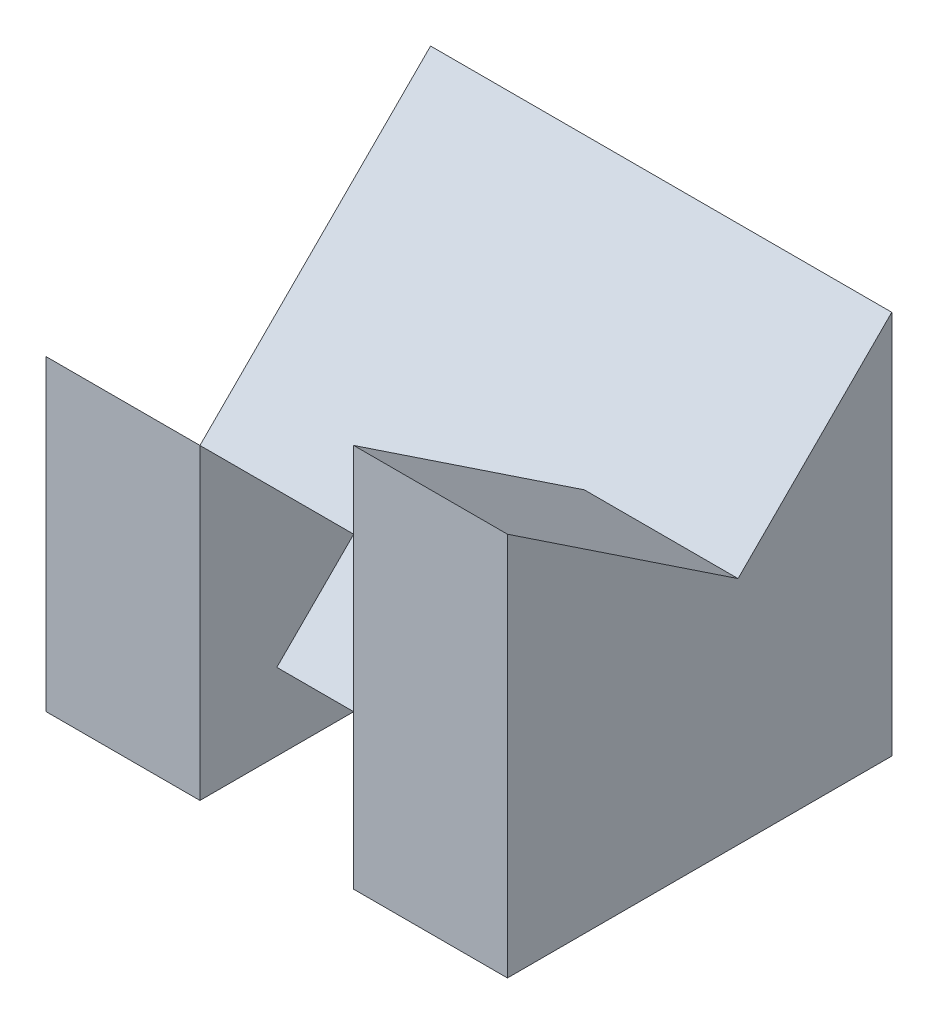
ISO-10303-21;
HEADER;
FILE_DESCRIPTION(('STEP AP214'),'2;1');
FILE_NAME('part.step','',(''),(''),'','','');
FILE_SCHEMA(('AUTOMOTIVE_DESIGN { 1 0 10303 214 1 1 1 1 }'));
ENDSEC;
DATA;
#1=APPLICATION_CONTEXT('core data for automotive mechanical design processes');
#2=APPLICATION_PROTOCOL_DEFINITION('international standard','automotive_design',2000,#1);
#3=PRODUCT_CONTEXT('',#1,'mechanical');
#4=PRODUCT('Part','Part','',(#3));
#5=PRODUCT_RELATED_PRODUCT_CATEGORY('part','',(#4));
#6=PRODUCT_DEFINITION_FORMATION('','',#4);
#7=PRODUCT_DEFINITION_CONTEXT('part definition',#1,'design');
#8=PRODUCT_DEFINITION('design','',#6,#7);
#9=PRODUCT_DEFINITION_SHAPE('','',#8);
#10=(LENGTH_UNIT() NAMED_UNIT(*) SI_UNIT(.MILLI.,.METRE.));
#11=(NAMED_UNIT(*) PLANE_ANGLE_UNIT() SI_UNIT($,.RADIAN.));
#12=(NAMED_UNIT(*) SI_UNIT($,.STERADIAN.) SOLID_ANGLE_UNIT());
#13=UNCERTAINTY_MEASURE_WITH_UNIT(LENGTH_MEASURE(1.E-05),#10,'distance_accuracy_value','');
#14=(GEOMETRIC_REPRESENTATION_CONTEXT(3) GLOBAL_UNCERTAINTY_ASSIGNED_CONTEXT((#13)) GLOBAL_UNIT_ASSIGNED_CONTEXT((#10,
#11,#12)) REPRESENTATION_CONTEXT('',''));
#15=CARTESIAN_POINT('',(0.,0.,0.));
#16=DIRECTION('',(0.,0.,1.));
#17=DIRECTION('',(1.,0.,0.));
#18=AXIS2_PLACEMENT_3D('',#15,#16,#17);
#19=CARTESIAN_POINT('',(0.,0.,5.));
#20=DIRECTION('',(0.,0.,-1.));
#21=DIRECTION('',(-1.,0.,0.));
#22=AXIS2_PLACEMENT_3D('',#19,#20,#21);
#23=PLANE('',#22);
#24=DIRECTION('',(0.,1.,0.));
#25=VECTOR('',#24,1.);
#26=CARTESIAN_POINT('',(2.,1.,5.));
#27=LINE('',#26,#25);
#28=CARTESIAN_POINT('',(2.,0.,5.));
#29=VERTEX_POINT('',#28);
#30=CARTESIAN_POINT('',(2.,4.,5.));
#31=VERTEX_POINT('',#30);
#32=EDGE_CURVE('E130',#29,#31,#27,.T.);
#33=ORIENTED_EDGE('',*,*,#32,.T.);
#34=DIRECTION('',(-1.,0.,0.));
#35=VECTOR('',#34,1.);
#36=CARTESIAN_POINT('',(2.,4.,5.));
#37=LINE('',#36,#35);
#38=CARTESIAN_POINT('',(0.,4.,5.));
#39=VERTEX_POINT('',#38);
#40=EDGE_CURVE('E194',#31,#39,#37,.T.);
#41=ORIENTED_EDGE('',*,*,#40,.T.);
#42=DIRECTION('',(0.,-1.,0.));
#43=VECTOR('',#42,1.);
#44=CARTESIAN_POINT('',(0.,0.,5.));
#45=LINE('',#44,#43);
#46=CARTESIAN_POINT('',(0.,0.,5.));
#47=VERTEX_POINT('',#46);
#48=EDGE_CURVE('E136',#39,#47,#45,.T.);
#49=ORIENTED_EDGE('',*,*,#48,.T.);
#50=DIRECTION('',(1.,0.,0.));
#51=VECTOR('',#50,1.);
#52=CARTESIAN_POINT('',(2.,0.,5.));
#53=LINE('',#52,#51);
#54=EDGE_CURVE('E166',#47,#29,#53,.T.);
#55=ORIENTED_EDGE('',*,*,#54,.T.);
#56=EDGE_LOOP('',(#33,#41,#49,#55));
#57=FACE_BOUND('',#56,.T.);
#58=ADVANCED_FACE('F33',(#57),#23,.F.);
#59=CARTESIAN_POINT('',(2.,0.,5.));
#60=DIRECTION('',(0.,1.,0.));
#61=DIRECTION('',(-1.,0.,0.));
#62=AXIS2_PLACEMENT_3D('',#59,#60,#61);
#63=PLANE('',#62);
#64=DIRECTION('',(1.,0.,0.));
#65=VECTOR('',#64,1.);
#66=CARTESIAN_POINT('',(2.,0.,0.));
#67=LINE('',#66,#65);
#68=CARTESIAN_POINT('',(0.,0.,0.));
#69=VERTEX_POINT('',#68);
#70=CARTESIAN_POINT('',(2.,0.,0.));
#71=VERTEX_POINT('',#70);
#72=EDGE_CURVE('E143',#69,#71,#67,.T.);
#73=ORIENTED_EDGE('',*,*,#72,.T.);
#74=DIRECTION('',(0.,0.,-1.));
#75=VECTOR('',#74,1.);
#76=CARTESIAN_POINT('',(2.,0.,5.));
#77=LINE('',#76,#75);
#78=EDGE_CURVE('E175',#29,#71,#77,.T.);
#79=ORIENTED_EDGE('',*,*,#78,.F.);
#80=ORIENTED_EDGE('',*,*,#54,.F.);
#81=DIRECTION('',(0.,0.,-1.));
#82=VECTOR('',#81,1.);
#83=CARTESIAN_POINT('',(0.,0.,5.));
#84=LINE('',#83,#82);
#85=EDGE_CURVE('E138',#47,#69,#84,.T.);
#86=ORIENTED_EDGE('',*,*,#85,.T.);
#87=EDGE_LOOP('',(#73,#79,#80,#86));
#88=FACE_BOUND('',#87,.T.);
#89=ADVANCED_FACE('F35',(#88),#63,.F.);
#90=CARTESIAN_POINT('',(2.,1.,5.));
#91=DIRECTION('',(-1.,0.,0.));
#92=DIRECTION('',(0.,0.,1.));
#93=AXIS2_PLACEMENT_3D('',#90,#91,#92);
#94=PLANE('',#93);
#95=DIRECTION('',(0.,-0.707106781186548,0.707106781186548));
#96=VECTOR('',#95,1.);
#97=CARTESIAN_POINT('',(2.,5.,0.));
#98=LINE('',#97,#96);
#99=CARTESIAN_POINT('',(2.,2.,3.));
#100=VERTEX_POINT('',#99);
#101=CARTESIAN_POINT('',(2.,1.,4.));
#102=VERTEX_POINT('',#101);
#103=EDGE_CURVE('E179',#100,#102,#98,.T.);
#104=ORIENTED_EDGE('',*,*,#103,.F.);
#105=DIRECTION('',(0.,0.707106781186547,0.707106781186548));
#106=VECTOR('',#105,1.);
#107=CARTESIAN_POINT('',(2.,4.,5.));
#108=LINE('',#107,#106);
#109=EDGE_CURVE('E56',#100,#31,#108,.T.);
#110=ORIENTED_EDGE('',*,*,#109,.T.);
#111=ORIENTED_EDGE('',*,*,#32,.F.);
#112=ORIENTED_EDGE('',*,*,#78,.T.);
#113=DIRECTION('',(0.,1.,0.));
#114=VECTOR('',#113,1.);
#115=CARTESIAN_POINT('',(2.,1.,0.));
#116=LINE('',#115,#114);
#117=CARTESIAN_POINT('',(2.,1.,0.));
#118=VERTEX_POINT('',#117);
#119=EDGE_CURVE('E146',#71,#118,#116,.T.);
#120=ORIENTED_EDGE('',*,*,#119,.T.);
#121=DIRECTION('',(0.,0.,-1.));
#122=VECTOR('',#121,1.);
#123=CARTESIAN_POINT('',(2.,1.,5.));
#124=LINE('',#123,#122);
#125=EDGE_CURVE('E173',#102,#118,#124,.T.);
#126=ORIENTED_EDGE('',*,*,#125,.F.);
#127=EDGE_LOOP('',(#104,#110,#111,#112,#120,#126));
#128=FACE_BOUND('',#127,.T.);
#129=ADVANCED_FACE('F224',(#128),#94,.F.);
#130=CARTESIAN_POINT('',(4.,1.,5.));
#131=DIRECTION('',(0.,1.,0.));
#132=DIRECTION('',(-1.,0.,0.));
#133=AXIS2_PLACEMENT_3D('',#130,#131,#132);
#134=PLANE('',#133);
#135=DIRECTION('',(0.,0.,-1.));
#136=VECTOR('',#135,1.);
#137=CARTESIAN_POINT('',(4.,1.,5.));
#138=LINE('',#137,#136);
#139=CARTESIAN_POINT('',(4.,1.,4.));
#140=VERTEX_POINT('',#139);
#141=CARTESIAN_POINT('',(4.,1.,0.));
#142=VERTEX_POINT('',#141);
#143=EDGE_CURVE('E171',#140,#142,#138,.T.);
#144=ORIENTED_EDGE('',*,*,#143,.F.);
#145=DIRECTION('',(-1.,0.,0.));
#146=VECTOR('',#145,1.);
#147=CARTESIAN_POINT('',(4.,1.,4.));
#148=LINE('',#147,#146);
#149=EDGE_CURVE('E147',#140,#102,#148,.T.);
#150=ORIENTED_EDGE('',*,*,#149,.T.);
#151=ORIENTED_EDGE('',*,*,#125,.T.);
#152=DIRECTION('',(1.,0.,0.));
#153=VECTOR('',#152,1.);
#154=CARTESIAN_POINT('',(4.,1.,0.));
#155=LINE('',#154,#153);
#156=EDGE_CURVE('E150',#118,#142,#155,.T.);
#157=ORIENTED_EDGE('',*,*,#156,.T.);
#158=EDGE_LOOP('',(#144,#150,#151,#157));
#159=FACE_BOUND('',#158,.T.);
#160=ADVANCED_FACE('F228',(#159),#134,.F.);
#161=CARTESIAN_POINT('',(4.,0.,5.));
#162=DIRECTION('',(1.,0.,0.));
#163=DIRECTION('',(0.,0.,-1.));
#164=AXIS2_PLACEMENT_3D('',#161,#162,#163);
#165=PLANE('',#164);
#166=DIRECTION('',(0.,-1.,0.));
#167=VECTOR('',#166,1.);
#168=CARTESIAN_POINT('',(4.,0.,5.));
#169=LINE('',#168,#167);
#170=CARTESIAN_POINT('',(4.,5.,5.));
#171=VERTEX_POINT('',#170);
#172=CARTESIAN_POINT('',(4.,0.,5.));
#173=VERTEX_POINT('',#172);
#174=EDGE_CURVE('E123',#171,#173,#169,.T.);
#175=ORIENTED_EDGE('',*,*,#174,.F.);
#176=DIRECTION('',(0.,-0.554700196225229,-0.832050294337844));
#177=VECTOR('',#176,1.);
#178=CARTESIAN_POINT('',(4.,5.,5.));
#179=LINE('',#178,#177);
#180=CARTESIAN_POINT('',(4.,3.,2.));
#181=VERTEX_POINT('',#180);
#182=EDGE_CURVE('E114',#171,#181,#179,.T.);
#183=ORIENTED_EDGE('',*,*,#182,.T.);
#184=DIRECTION('',(0.,0.707106781186548,-0.707106781186548));
#185=VECTOR('',#184,1.);
#186=CARTESIAN_POINT('',(4.,5.,0.));
#187=LINE('',#186,#185);
#188=EDGE_CURVE('E11',#140,#181,#187,.T.);
#189=ORIENTED_EDGE('',*,*,#188,.F.);
#190=ORIENTED_EDGE('',*,*,#143,.T.);
#191=DIRECTION('',(0.,-1.,0.));
#192=VECTOR('',#191,1.);
#193=CARTESIAN_POINT('',(4.,0.,0.));
#194=LINE('',#193,#192);
#195=CARTESIAN_POINT('',(4.,0.,0.));
#196=VERTEX_POINT('',#195);
#197=EDGE_CURVE('E153',#142,#196,#194,.T.);
#198=ORIENTED_EDGE('',*,*,#197,.T.);
#199=DIRECTION('',(0.,0.,-1.));
#200=VECTOR('',#199,1.);
#201=CARTESIAN_POINT('',(4.,0.,5.));
#202=LINE('',#201,#200);
#203=EDGE_CURVE('E126',#173,#196,#202,.T.);
#204=ORIENTED_EDGE('',*,*,#203,.F.);
#205=EDGE_LOOP('',(#175,#183,#189,#190,#198,#204));
#206=FACE_BOUND('',#205,.T.);
#207=ADVANCED_FACE('F124',(#206),#165,.F.);
#208=CARTESIAN_POINT('',(6.,0.,5.));
#209=DIRECTION('',(0.,1.,0.));
#210=DIRECTION('',(-1.,0.,0.));
#211=AXIS2_PLACEMENT_3D('',#208,#209,#210);
#212=PLANE('',#211);
#213=DIRECTION('',(1.,0.,0.));
#214=VECTOR('',#213,1.);
#215=CARTESIAN_POINT('',(6.,0.,0.));
#216=LINE('',#215,#214);
#217=CARTESIAN_POINT('',(6.,0.,0.));
#218=VERTEX_POINT('',#217);
#219=EDGE_CURVE('E155',#196,#218,#216,.T.);
#220=ORIENTED_EDGE('',*,*,#219,.T.);
#221=DIRECTION('',(0.,0.,-1.));
#222=VECTOR('',#221,1.);
#223=CARTESIAN_POINT('',(6.,0.,5.));
#224=LINE('',#223,#222);
#225=CARTESIAN_POINT('',(6.,0.,5.));
#226=VERTEX_POINT('',#225);
#227=EDGE_CURVE('E168',#226,#218,#224,.T.);
#228=ORIENTED_EDGE('',*,*,#227,.F.);
#229=DIRECTION('',(1.,0.,0.));
#230=VECTOR('',#229,1.);
#231=CARTESIAN_POINT('',(6.,0.,5.));
#232=LINE('',#231,#230);
#233=EDGE_CURVE('E129',#173,#226,#232,.T.);
#234=ORIENTED_EDGE('',*,*,#233,.F.);
#235=ORIENTED_EDGE('',*,*,#203,.T.);
#236=EDGE_LOOP('',(#220,#228,#234,#235));
#237=FACE_BOUND('',#236,.T.);
#238=ADVANCED_FACE('F203',(#237),#212,.F.);
#239=CARTESIAN_POINT('',(6.,5.,5.));
#240=DIRECTION('',(-1.,0.,0.));
#241=DIRECTION('',(0.,-1.,0.));
#242=AXIS2_PLACEMENT_3D('',#239,#240,#241);
#243=PLANE('',#242);
#244=DIRECTION('',(0.,-0.707106781186548,0.707106781186548));
#245=VECTOR('',#244,1.);
#246=CARTESIAN_POINT('',(6.,2.5,2.5));
#247=LINE('',#246,#245);
#248=CARTESIAN_POINT('',(6.,5.,0.));
#249=VERTEX_POINT('',#248);
#250=CARTESIAN_POINT('',(6.,3.,2.));
#251=VERTEX_POINT('',#250);
#252=EDGE_CURVE('E184',#249,#251,#247,.T.);
#253=ORIENTED_EDGE('',*,*,#252,.T.);
#254=DIRECTION('',(0.,-0.554700196225229,-0.832050294337844));
#255=VECTOR('',#254,1.);
#256=CARTESIAN_POINT('',(6.,5.,5.));
#257=LINE('',#256,#255);
#258=CARTESIAN_POINT('',(6.,5.,5.));
#259=VERTEX_POINT('',#258);
#260=EDGE_CURVE('E48',#259,#251,#257,.T.);
#261=ORIENTED_EDGE('',*,*,#260,.F.);
#262=DIRECTION('',(0.,1.,0.));
#263=VECTOR('',#262,1.);
#264=CARTESIAN_POINT('',(6.,5.,5.));
#265=LINE('',#264,#263);
#266=EDGE_CURVE('E135',#226,#259,#265,.T.);
#267=ORIENTED_EDGE('',*,*,#266,.F.);
#268=ORIENTED_EDGE('',*,*,#227,.T.);
#269=DIRECTION('',(0.,1.,0.));
#270=VECTOR('',#269,1.);
#271=CARTESIAN_POINT('',(6.,5.,0.));
#272=LINE('',#271,#270);
#273=EDGE_CURVE('E158',#218,#249,#272,.T.);
#274=ORIENTED_EDGE('',*,*,#273,.T.);
#275=EDGE_LOOP('',(#253,#261,#267,#268,#274));
#276=FACE_BOUND('',#275,.T.);
#277=ADVANCED_FACE('F186',(#276),#243,.F.);
#278=CARTESIAN_POINT('',(0.,0.,5.));
#279=DIRECTION('',(1.,0.,0.));
#280=DIRECTION('',(0.,0.,-1.));
#281=AXIS2_PLACEMENT_3D('',#278,#279,#280);
#282=PLANE('',#281);
#283=ORIENTED_EDGE('',*,*,#48,.F.);
#284=DIRECTION('',(0.,0.707106781186547,0.707106781186548));
#285=VECTOR('',#284,1.);
#286=CARTESIAN_POINT('',(0.,4.,5.));
#287=LINE('',#286,#285);
#288=CARTESIAN_POINT('',(0.,2.,3.));
#289=VERTEX_POINT('',#288);
#290=EDGE_CURVE('E120',#289,#39,#287,.T.);
#291=ORIENTED_EDGE('',*,*,#290,.F.);
#292=DIRECTION('',(0.,-0.707106781186548,0.707106781186548));
#293=VECTOR('',#292,1.);
#294=CARTESIAN_POINT('',(0.,5.,0.));
#295=LINE('',#294,#293);
#296=CARTESIAN_POINT('',(0.,5.,0.));
#297=VERTEX_POINT('',#296);
#298=EDGE_CURVE('E189',#297,#289,#295,.T.);
#299=ORIENTED_EDGE('',*,*,#298,.F.);
#300=DIRECTION('',(0.,-1.,0.));
#301=VECTOR('',#300,1.);
#302=CARTESIAN_POINT('',(0.,0.,0.));
#303=LINE('',#302,#301);
#304=EDGE_CURVE('E163',#297,#69,#303,.T.);
#305=ORIENTED_EDGE('',*,*,#304,.T.);
#306=ORIENTED_EDGE('',*,*,#85,.F.);
#307=EDGE_LOOP('',(#283,#291,#299,#305,#306));
#308=FACE_BOUND('',#307,.T.);
#309=ADVANCED_FACE('F214',(#308),#282,.F.);
#310=DIRECTION('',(-1.,0.,0.));
#311=VECTOR('',#310,1.);
#312=CARTESIAN_POINT('',(0.,5.,5.));
#313=LINE('',#312,#311);
#314=EDGE_CURVE('E118',#259,#171,#313,.T.);
#315=ORIENTED_EDGE('',*,*,#314,.T.);
#316=ORIENTED_EDGE('',*,*,#174,.T.);
#317=ORIENTED_EDGE('',*,*,#233,.T.);
#318=ORIENTED_EDGE('',*,*,#266,.T.);
#319=EDGE_LOOP('',(#315,#316,#317,#318));
#320=FACE_BOUND('',#319,.T.);
#321=ADVANCED_FACE('F133',(#320),#23,.F.);
#322=CARTESIAN_POINT('',(0.,0.,0.));
#323=DIRECTION('',(0.,0.,-1.));
#324=DIRECTION('',(-1.,0.,0.));
#325=AXIS2_PLACEMENT_3D('',#322,#323,#324);
#326=PLANE('',#325);
#327=ORIENTED_EDGE('',*,*,#72,.F.);
#328=ORIENTED_EDGE('',*,*,#304,.F.);
#329=DIRECTION('',(-1.,0.,0.));
#330=VECTOR('',#329,1.);
#331=CARTESIAN_POINT('',(0.,5.,0.));
#332=LINE('',#331,#330);
#333=EDGE_CURVE('E161',#249,#297,#332,.T.);
#334=ORIENTED_EDGE('',*,*,#333,.F.);
#335=ORIENTED_EDGE('',*,*,#273,.F.);
#336=ORIENTED_EDGE('',*,*,#219,.F.);
#337=ORIENTED_EDGE('',*,*,#197,.F.);
#338=ORIENTED_EDGE('',*,*,#156,.F.);
#339=ORIENTED_EDGE('',*,*,#119,.F.);
#340=EDGE_LOOP('',(#327,#328,#334,#335,#336,#337,#338,#339));
#341=FACE_BOUND('',#340,.T.);
#342=ADVANCED_FACE('F208',(#341),#326,.T.);
#343=CARTESIAN_POINT('',(7.,5.,0.));
#344=DIRECTION('',(0.,-0.707106781186547,-0.707106781186547));
#345=DIRECTION('',(0.,0.707106781186548,-0.707106781186548));
#346=AXIS2_PLACEMENT_3D('',#343,#344,#345);
#347=PLANE('',#346);
#348=ORIENTED_EDGE('',*,*,#149,.F.);
#349=ORIENTED_EDGE('',*,*,#188,.T.);
#350=DIRECTION('',(1.,0.,0.));
#351=VECTOR('',#350,1.);
#352=CARTESIAN_POINT('',(7.,3.,2.));
#353=LINE('',#352,#351);
#354=EDGE_CURVE('E41',#181,#251,#353,.T.);
#355=ORIENTED_EDGE('',*,*,#354,.T.);
#356=ORIENTED_EDGE('',*,*,#252,.F.);
#357=ORIENTED_EDGE('',*,*,#333,.T.);
#358=ORIENTED_EDGE('',*,*,#298,.T.);
#359=DIRECTION('',(1.,0.,0.));
#360=VECTOR('',#359,1.);
#361=CARTESIAN_POINT('',(7.,2.,3.));
#362=LINE('',#361,#360);
#363=EDGE_CURVE('E177',#289,#100,#362,.T.);
#364=ORIENTED_EDGE('',*,*,#363,.T.);
#365=ORIENTED_EDGE('',*,*,#103,.T.);
#366=EDGE_LOOP('',(#348,#349,#355,#356,#357,#358,#364,#365));
#367=FACE_BOUND('',#366,.T.);
#368=ADVANCED_FACE('F183',(#367),#347,.F.);
#369=CARTESIAN_POINT('',(2.,4.,5.));
#370=DIRECTION('',(0.,-0.707106781186548,0.707106781186547));
#371=DIRECTION('',(0.,-0.707106781186547,-0.707106781186548));
#372=AXIS2_PLACEMENT_3D('',#369,#370,#371);
#373=PLANE('',#372);
#374=ORIENTED_EDGE('',*,*,#290,.T.);
#375=ORIENTED_EDGE('',*,*,#40,.F.);
#376=ORIENTED_EDGE('',*,*,#109,.F.);
#377=ORIENTED_EDGE('',*,*,#363,.F.);
#378=EDGE_LOOP('',(#374,#375,#376,#377));
#379=FACE_BOUND('',#378,.T.);
#380=ADVANCED_FACE('F221',(#379),#373,.F.);
#381=CARTESIAN_POINT('',(4.,5.,5.));
#382=DIRECTION('',(0.,-0.832050294337844,0.554700196225229));
#383=DIRECTION('',(0.,-0.554700196225229,-0.832050294337844));
#384=AXIS2_PLACEMENT_3D('',#381,#382,#383);
#385=PLANE('',#384);
#386=ORIENTED_EDGE('',*,*,#260,.T.);
#387=ORIENTED_EDGE('',*,*,#354,.F.);
#388=ORIENTED_EDGE('',*,*,#182,.F.);
#389=ORIENTED_EDGE('',*,*,#314,.F.);
#390=EDGE_LOOP('',(#386,#387,#388,#389));
#391=FACE_BOUND('',#390,.T.);
#392=ADVANCED_FACE('F116',(#391),#385,.F.);
#393=CLOSED_SHELL('',(#58,#89,#129,#160,#207,#238,#277,#309,#321,#342,#368,#380,#392));
#394=MANIFOLD_SOLID_BREP('B2',#393);
#395=ADVANCED_BREP_SHAPE_REPRESENTATION('',(#18,#394),#14);
#396=SHAPE_DEFINITION_REPRESENTATION(#9,#395);
ENDSEC;
END-ISO-10303-21;
